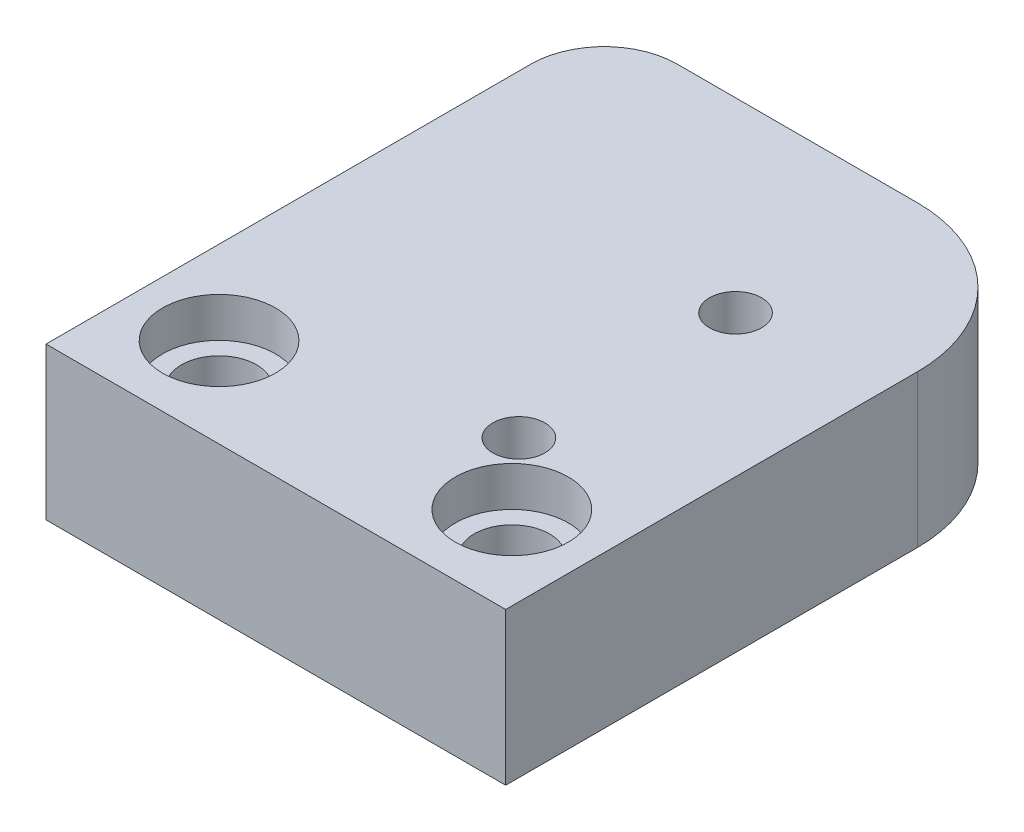
ISO-10303-21;
HEADER;
FILE_DESCRIPTION(('STEP AP214'),'2;1');
FILE_NAME('part.step','',(''),(''),'','','');
FILE_SCHEMA(('AUTOMOTIVE_DESIGN { 1 0 10303 214 1 1 1 1 }'));
ENDSEC;
DATA;
#1=APPLICATION_CONTEXT('core data for automotive mechanical design processes');
#2=APPLICATION_PROTOCOL_DEFINITION('international standard','automotive_design',2000,#1);
#3=PRODUCT_CONTEXT('',#1,'mechanical');
#4=PRODUCT('Part','Part','',(#3));
#5=PRODUCT_RELATED_PRODUCT_CATEGORY('part','',(#4));
#6=PRODUCT_DEFINITION_FORMATION('','',#4);
#7=PRODUCT_DEFINITION_CONTEXT('part definition',#1,'design');
#8=PRODUCT_DEFINITION('design','',#6,#7);
#9=PRODUCT_DEFINITION_SHAPE('','',#8);
#10=(LENGTH_UNIT() NAMED_UNIT(*) SI_UNIT(.MILLI.,.METRE.));
#11=(NAMED_UNIT(*) PLANE_ANGLE_UNIT() SI_UNIT($,.RADIAN.));
#12=(NAMED_UNIT(*) SI_UNIT($,.STERADIAN.) SOLID_ANGLE_UNIT());
#13=UNCERTAINTY_MEASURE_WITH_UNIT(LENGTH_MEASURE(1.E-05),#10,'distance_accuracy_value','');
#14=(GEOMETRIC_REPRESENTATION_CONTEXT(3) GLOBAL_UNCERTAINTY_ASSIGNED_CONTEXT((#13)) GLOBAL_UNIT_ASSIGNED_CONTEXT((#10,
#11,#12)) REPRESENTATION_CONTEXT('',''));
#15=CARTESIAN_POINT('',(0.,0.,0.));
#16=DIRECTION('',(0.,0.,1.));
#17=DIRECTION('',(1.,0.,0.));
#18=AXIS2_PLACEMENT_3D('',#15,#16,#17);
#19=CARTESIAN_POINT('',(-9.9695,6.604,-24.2062));
#20=DIRECTION('',(1.,0.,0.));
#21=DIRECTION('',(0.,0.,-1.));
#22=AXIS2_PLACEMENT_3D('',#19,#20,#21);
#23=PLANE('',#22);
#24=DIRECTION('',(0.,0.,1.));
#25=VECTOR('',#24,1.);
#26=CARTESIAN_POINT('',(-9.9695,6.604,-24.2062));
#27=LINE('',#26,#25);
#28=CARTESIAN_POINT('',(-9.9695,6.604,-21.0312));
#29=VERTEX_POINT('',#28);
#30=CARTESIAN_POINT('',(-9.96950000000001,6.604,0.));
#31=VERTEX_POINT('',#30);
#32=EDGE_CURVE('E85',#29,#31,#27,.T.);
#33=ORIENTED_EDGE('',*,*,#32,.F.);
#34=DIRECTION('',(0.,-1.,0.));
#35=VECTOR('',#34,1.);
#36=CARTESIAN_POINT('',(-9.9695,6.604,-21.0312));
#37=LINE('',#36,#35);
#38=CARTESIAN_POINT('',(-9.9695,0.,-21.0312));
#39=VERTEX_POINT('',#38);
#40=EDGE_CURVE('E123',#29,#39,#37,.T.);
#41=ORIENTED_EDGE('',*,*,#40,.T.);
#42=DIRECTION('',(0.,0.,1.));
#43=VECTOR('',#42,1.);
#44=CARTESIAN_POINT('',(-9.9695,0.,-24.2062));
#45=LINE('',#44,#43);
#46=CARTESIAN_POINT('',(-9.96950000000001,0.,0.));
#47=VERTEX_POINT('',#46);
#48=EDGE_CURVE('E107',#39,#47,#45,.T.);
#49=ORIENTED_EDGE('',*,*,#48,.T.);
#50=DIRECTION('',(0.,-1.,0.));
#51=VECTOR('',#50,1.);
#52=CARTESIAN_POINT('',(-9.96950000000001,6.604,0.));
#53=LINE('',#52,#51);
#54=EDGE_CURVE('E101',#31,#47,#53,.T.);
#55=ORIENTED_EDGE('',*,*,#54,.F.);
#56=EDGE_LOOP('',(#33,#41,#49,#55));
#57=FACE_BOUND('',#56,.T.);
#58=ADVANCED_FACE('F33',(#57),#23,.F.);
#59=CARTESIAN_POINT('',(-9.96950000000001,6.604,0.));
#60=DIRECTION('',(0.,0.,-1.));
#61=DIRECTION('',(-1.,0.,0.));
#62=AXIS2_PLACEMENT_3D('',#59,#60,#61);
#63=PLANE('',#62);
#64=DIRECTION('',(1.,0.,0.));
#65=VECTOR('',#64,1.);
#66=CARTESIAN_POINT('',(-9.96950000000001,0.,0.));
#67=LINE('',#66,#65);
#68=CARTESIAN_POINT('',(9.96950000000001,0.,0.));
#69=VERTEX_POINT('',#68);
#70=EDGE_CURVE('E128',#47,#69,#67,.T.);
#71=ORIENTED_EDGE('',*,*,#70,.T.);
#72=DIRECTION('',(0.,-1.,0.));
#73=VECTOR('',#72,1.);
#74=CARTESIAN_POINT('',(9.96950000000001,6.604,0.));
#75=LINE('',#74,#73);
#76=CARTESIAN_POINT('',(9.96950000000001,6.604,0.));
#77=VERTEX_POINT('',#76);
#78=EDGE_CURVE('E103',#77,#69,#75,.T.);
#79=ORIENTED_EDGE('',*,*,#78,.F.);
#80=DIRECTION('',(1.,0.,0.));
#81=VECTOR('',#80,1.);
#82=CARTESIAN_POINT('',(-9.96950000000001,6.604,0.));
#83=LINE('',#82,#81);
#84=EDGE_CURVE('E89',#31,#77,#83,.T.);
#85=ORIENTED_EDGE('',*,*,#84,.F.);
#86=ORIENTED_EDGE('',*,*,#54,.T.);
#87=EDGE_LOOP('',(#71,#79,#85,#86));
#88=FACE_BOUND('',#87,.T.);
#89=ADVANCED_FACE('F100',(#88),#63,.F.);
#90=CARTESIAN_POINT('',(9.9695,6.604,-24.2062));
#91=DIRECTION('',(-1.,0.,0.));
#92=DIRECTION('',(0.,0.,1.));
#93=AXIS2_PLACEMENT_3D('',#90,#91,#92);
#94=PLANE('',#93);
#95=DIRECTION('',(0.,0.,-1.));
#96=VECTOR('',#95,1.);
#97=CARTESIAN_POINT('',(9.9695,0.,-24.2062));
#98=LINE('',#97,#96);
#99=CARTESIAN_POINT('',(9.9695,0.,-17.8562));
#100=VERTEX_POINT('',#99);
#101=EDGE_CURVE('E131',#69,#100,#98,.T.);
#102=ORIENTED_EDGE('',*,*,#101,.T.);
#103=DIRECTION('',(0.,-1.,0.));
#104=VECTOR('',#103,1.);
#105=CARTESIAN_POINT('',(9.9695,6.604,-17.8562));
#106=LINE('',#105,#104);
#107=CARTESIAN_POINT('',(9.9695,6.604,-17.8562));
#108=VERTEX_POINT('',#107);
#109=EDGE_CURVE('E119',#100,#108,#106,.F.);
#110=ORIENTED_EDGE('',*,*,#109,.T.);
#111=DIRECTION('',(0.,0.,-1.));
#112=VECTOR('',#111,1.);
#113=CARTESIAN_POINT('',(9.9695,6.604,-24.2062));
#114=LINE('',#113,#112);
#115=EDGE_CURVE('E105',#77,#108,#114,.T.);
#116=ORIENTED_EDGE('',*,*,#115,.F.);
#117=ORIENTED_EDGE('',*,*,#78,.T.);
#118=EDGE_LOOP('',(#102,#110,#116,#117));
#119=FACE_BOUND('',#118,.T.);
#120=ADVANCED_FACE('F154',(#119),#94,.F.);
#121=CARTESIAN_POINT('',(-9.9695,6.604,-24.2062));
#122=DIRECTION('',(0.,0.,1.));
#123=DIRECTION('',(1.,0.,0.));
#124=AXIS2_PLACEMENT_3D('',#121,#122,#123);
#125=PLANE('',#124);
#126=DIRECTION('',(-1.,0.,0.));
#127=VECTOR('',#126,1.);
#128=CARTESIAN_POINT('',(-9.9695,0.,-24.2062));
#129=LINE('',#128,#127);
#130=CARTESIAN_POINT('',(3.61950000000001,0.,-24.2062));
#131=VERTEX_POINT('',#130);
#132=CARTESIAN_POINT('',(-6.7945,0.,-24.2062));
#133=VERTEX_POINT('',#132);
#134=EDGE_CURVE('E96',#131,#133,#129,.T.);
#135=ORIENTED_EDGE('',*,*,#134,.T.);
#136=DIRECTION('',(0.,-1.,0.));
#137=VECTOR('',#136,1.);
#138=CARTESIAN_POINT('',(-6.7945,6.604,-24.2062));
#139=LINE('',#138,#137);
#140=CARTESIAN_POINT('',(-6.7945,6.604,-24.2062));
#141=VERTEX_POINT('',#140);
#142=EDGE_CURVE('E41',#133,#141,#139,.F.);
#143=ORIENTED_EDGE('',*,*,#142,.T.);
#144=DIRECTION('',(-1.,0.,0.));
#145=VECTOR('',#144,1.);
#146=CARTESIAN_POINT('',(-9.9695,6.604,-24.2062));
#147=LINE('',#146,#145);
#148=CARTESIAN_POINT('',(3.61950000000001,6.604,-24.2062));
#149=VERTEX_POINT('',#148);
#150=EDGE_CURVE('E114',#149,#141,#147,.T.);
#151=ORIENTED_EDGE('',*,*,#150,.F.);
#152=DIRECTION('',(0.,-1.,0.));
#153=VECTOR('',#152,1.);
#154=CARTESIAN_POINT('',(3.61950000000001,6.604,-24.2062));
#155=LINE('',#154,#153);
#156=EDGE_CURVE('E109',#149,#131,#155,.T.);
#157=ORIENTED_EDGE('',*,*,#156,.T.);
#158=EDGE_LOOP('',(#135,#143,#151,#157));
#159=FACE_BOUND('',#158,.T.);
#160=ADVANCED_FACE('F140',(#159),#125,.F.);
#161=CARTESIAN_POINT('',(0.,6.604,0.));
#162=DIRECTION('',(0.,1.,0.));
#163=DIRECTION('',(0.,0.,1.));
#164=AXIS2_PLACEMENT_3D('',#161,#162,#163);
#165=PLANE('',#164);
#166=CARTESIAN_POINT('',(-6.35,6.604,-3.8862));
#167=DIRECTION('',(0.,1.,0.));
#168=DIRECTION('',(0.,0.,1.));
#169=AXIS2_PLACEMENT_3D('',#166,#167,#168);
#170=CIRCLE('',#169,2.4511);
#171=CARTESIAN_POINT('',(-6.35,6.604,-1.4351));
#172=VERTEX_POINT('',#171);
#173=EDGE_CURVE('E206',#172,#172,#170,.T.);
#174=ORIENTED_EDGE('',*,*,#173,.F.);
#175=EDGE_LOOP('',(#174));
#176=FACE_BOUND('',#175,.T.);
#177=CARTESIAN_POINT('',(6.35,6.604,-3.8862));
#178=DIRECTION('',(0.,1.,0.));
#179=DIRECTION('',(0.,0.,1.));
#180=AXIS2_PLACEMENT_3D('',#177,#178,#179);
#181=CIRCLE('',#180,2.4511);
#182=CARTESIAN_POINT('',(6.35,6.604,-1.4351));
#183=VERTEX_POINT('',#182);
#184=EDGE_CURVE('E216',#183,#183,#181,.T.);
#185=ORIENTED_EDGE('',*,*,#184,.F.);
#186=EDGE_LOOP('',(#185));
#187=FACE_BOUND('',#186,.T.);
#188=CARTESIAN_POINT('',(3.81,6.604,-16.129));
#189=DIRECTION('',(0.,1.,0.));
#190=DIRECTION('',(0.,0.,1.));
#191=AXIS2_PLACEMENT_3D('',#188,#189,#190);
#192=CIRCLE('',#191,1.13029999999999);
#193=CARTESIAN_POINT('',(3.81,6.604,-14.9987));
#194=VERTEX_POINT('',#193);
#195=EDGE_CURVE('E228',#194,#194,#192,.T.);
#196=ORIENTED_EDGE('',*,*,#195,.F.);
#197=EDGE_LOOP('',(#196));
#198=FACE_BOUND('',#197,.T.);
#199=CARTESIAN_POINT('',(3.81,6.604,-6.731));
#200=DIRECTION('',(0.,1.,0.));
#201=DIRECTION('',(0.,0.,1.));
#202=AXIS2_PLACEMENT_3D('',#199,#200,#201);
#203=CIRCLE('',#202,1.13029999999999);
#204=CARTESIAN_POINT('',(3.81,6.604,-5.60070000000001));
#205=VERTEX_POINT('',#204);
#206=EDGE_CURVE('E134',#205,#205,#203,.T.);
#207=ORIENTED_EDGE('',*,*,#206,.F.);
#208=EDGE_LOOP('',(#207));
#209=FACE_BOUND('',#208,.T.);
#210=ORIENTED_EDGE('',*,*,#150,.T.);
#211=CARTESIAN_POINT('',(-6.7945,6.604,-21.0312));
#212=DIRECTION('',(0.,1.,0.));
#213=DIRECTION('',(0.,0.,1.));
#214=AXIS2_PLACEMENT_3D('',#211,#212,#213);
#215=CIRCLE('',#214,3.175);
#216=EDGE_CURVE('E11',#141,#29,#215,.T.);
#217=ORIENTED_EDGE('',*,*,#216,.T.);
#218=ORIENTED_EDGE('',*,*,#32,.T.);
#219=ORIENTED_EDGE('',*,*,#84,.T.);
#220=ORIENTED_EDGE('',*,*,#115,.T.);
#221=CARTESIAN_POINT('',(3.6195,6.604,-17.8562));
#222=DIRECTION('',(0.,1.,0.));
#223=DIRECTION('',(0.,0.,1.));
#224=AXIS2_PLACEMENT_3D('',#221,#222,#223);
#225=CIRCLE('',#224,6.35);
#226=EDGE_CURVE('E121',#108,#149,#225,.T.);
#227=ORIENTED_EDGE('',*,*,#226,.T.);
#228=EDGE_LOOP('',(#210,#217,#218,#219,#220,#227));
#229=FACE_BOUND('',#228,.T.);
#230=ADVANCED_FACE('F87',(#176,#187,#198,#209,#229),#165,.T.);
#231=CARTESIAN_POINT('',(0.,0.,0.));
#232=DIRECTION('',(0.,1.,0.));
#233=DIRECTION('',(0.,0.,1.));
#234=AXIS2_PLACEMENT_3D('',#231,#232,#233);
#235=PLANE('',#234);
#236=CARTESIAN_POINT('',(-6.35,0.,-3.8862));
#237=DIRECTION('',(0.,1.,0.));
#238=DIRECTION('',(0.,0.,1.));
#239=AXIS2_PLACEMENT_3D('',#236,#237,#238);
#240=CIRCLE('',#239,1.63195);
#241=CARTESIAN_POINT('',(-6.35,0.,-2.25425));
#242=VERTEX_POINT('',#241);
#243=EDGE_CURVE('E213',#242,#242,#240,.T.);
#244=ORIENTED_EDGE('',*,*,#243,.T.);
#245=EDGE_LOOP('',(#244));
#246=FACE_BOUND('',#245,.T.);
#247=CARTESIAN_POINT('',(6.35,0.,-3.8862));
#248=DIRECTION('',(0.,1.,0.));
#249=DIRECTION('',(0.,0.,1.));
#250=AXIS2_PLACEMENT_3D('',#247,#248,#249);
#251=CIRCLE('',#250,1.63195);
#252=CARTESIAN_POINT('',(6.35,0.,-2.25425));
#253=VERTEX_POINT('',#252);
#254=EDGE_CURVE('E225',#253,#253,#251,.T.);
#255=ORIENTED_EDGE('',*,*,#254,.T.);
#256=EDGE_LOOP('',(#255));
#257=FACE_BOUND('',#256,.T.);
#258=CARTESIAN_POINT('',(3.81,0.,-16.129));
#259=DIRECTION('',(0.,1.,0.));
#260=DIRECTION('',(0.,0.,1.));
#261=AXIS2_PLACEMENT_3D('',#258,#259,#260);
#262=CIRCLE('',#261,1.13029999999999);
#263=CARTESIAN_POINT('',(3.81,0.,-14.9987));
#264=VERTEX_POINT('',#263);
#265=EDGE_CURVE('E231',#264,#264,#262,.T.);
#266=ORIENTED_EDGE('',*,*,#265,.T.);
#267=EDGE_LOOP('',(#266));
#268=FACE_BOUND('',#267,.T.);
#269=CARTESIAN_POINT('',(3.81,0.,-6.731));
#270=DIRECTION('',(0.,1.,0.));
#271=DIRECTION('',(0.,0.,1.));
#272=AXIS2_PLACEMENT_3D('',#269,#270,#271);
#273=CIRCLE('',#272,1.13029999999999);
#274=CARTESIAN_POINT('',(3.81,0.,-5.60070000000001));
#275=VERTEX_POINT('',#274);
#276=EDGE_CURVE('E129',#275,#275,#273,.T.);
#277=ORIENTED_EDGE('',*,*,#276,.T.);
#278=EDGE_LOOP('',(#277));
#279=FACE_BOUND('',#278,.T.);
#280=ORIENTED_EDGE('',*,*,#48,.F.);
#281=CARTESIAN_POINT('',(-6.7945,0.,-21.0312));
#282=DIRECTION('',(0.,1.,0.));
#283=DIRECTION('',(0.,0.,1.));
#284=AXIS2_PLACEMENT_3D('',#281,#282,#283);
#285=CIRCLE('',#284,3.175);
#286=EDGE_CURVE('E55',#39,#133,#285,.F.);
#287=ORIENTED_EDGE('',*,*,#286,.T.);
#288=ORIENTED_EDGE('',*,*,#134,.F.);
#289=CARTESIAN_POINT('',(3.6195,0.,-17.8562));
#290=DIRECTION('',(0.,1.,0.));
#291=DIRECTION('',(0.,0.,1.));
#292=AXIS2_PLACEMENT_3D('',#289,#290,#291);
#293=CIRCLE('',#292,6.35);
#294=EDGE_CURVE('E112',#131,#100,#293,.F.);
#295=ORIENTED_EDGE('',*,*,#294,.T.);
#296=ORIENTED_EDGE('',*,*,#101,.F.);
#297=ORIENTED_EDGE('',*,*,#70,.F.);
#298=EDGE_LOOP('',(#280,#287,#288,#295,#296,#297));
#299=FACE_BOUND('',#298,.T.);
#300=ADVANCED_FACE('F126',(#246,#257,#268,#279,#299),#235,.F.);
#301=CARTESIAN_POINT('',(3.81,6.604,-6.731));
#302=DIRECTION('',(0.,1.,0.));
#303=DIRECTION('',(0.,0.,1.));
#304=AXIS2_PLACEMENT_3D('',#301,#302,#303);
#305=CYLINDRICAL_SURFACE('',#304,1.13029999999999);
#306=ORIENTED_EDGE('',*,*,#276,.F.);
#307=EDGE_LOOP('',(#306));
#308=FACE_BOUND('',#307,.T.);
#309=ORIENTED_EDGE('',*,*,#206,.T.);
#310=EDGE_LOOP('',(#309));
#311=FACE_BOUND('',#310,.T.);
#312=ADVANCED_FACE('F164',(#308,#311),#305,.F.);
#313=CARTESIAN_POINT('',(3.81,6.604,-16.129));
#314=DIRECTION('',(0.,1.,0.));
#315=DIRECTION('',(0.,0.,1.));
#316=AXIS2_PLACEMENT_3D('',#313,#314,#315);
#317=CYLINDRICAL_SURFACE('',#316,1.13029999999999);
#318=ORIENTED_EDGE('',*,*,#265,.F.);
#319=EDGE_LOOP('',(#318));
#320=FACE_BOUND('',#319,.T.);
#321=ORIENTED_EDGE('',*,*,#195,.T.);
#322=EDGE_LOOP('',(#321));
#323=FACE_BOUND('',#322,.T.);
#324=ADVANCED_FACE('F171',(#320,#323),#317,.F.);
#325=CARTESIAN_POINT('',(6.35,6.604,-3.8862));
#326=DIRECTION('',(0.,1.,0.));
#327=DIRECTION('',(0.,0.,1.));
#328=AXIS2_PLACEMENT_3D('',#325,#326,#327);
#329=CYLINDRICAL_SURFACE('',#328,1.63195);
#330=ORIENTED_EDGE('',*,*,#254,.F.);
#331=EDGE_LOOP('',(#330));
#332=FACE_BOUND('',#331,.T.);
#333=CARTESIAN_POINT('',(6.35,4.8768,-3.8862));
#334=DIRECTION('',(0.,1.,0.));
#335=DIRECTION('',(0.,0.,1.));
#336=AXIS2_PLACEMENT_3D('',#333,#334,#335);
#337=CIRCLE('',#336,1.63195);
#338=CARTESIAN_POINT('',(6.35,4.8768,-2.25425));
#339=VERTEX_POINT('',#338);
#340=EDGE_CURVE('E222',#339,#339,#337,.T.);
#341=ORIENTED_EDGE('',*,*,#340,.T.);
#342=EDGE_LOOP('',(#341));
#343=FACE_BOUND('',#342,.T.);
#344=ADVANCED_FACE('F175',(#332,#343),#329,.F.);
#345=CARTESIAN_POINT('',(7.98195,4.8768,-3.8862));
#346=DIRECTION('',(0.,-1.,0.));
#347=DIRECTION('',(0.,0.,-1.));
#348=AXIS2_PLACEMENT_3D('',#345,#346,#347);
#349=PLANE('',#348);
#350=ORIENTED_EDGE('',*,*,#340,.F.);
#351=EDGE_LOOP('',(#350));
#352=FACE_BOUND('',#351,.T.);
#353=CARTESIAN_POINT('',(6.35,4.8768,-3.8862));
#354=DIRECTION('',(0.,1.,0.));
#355=DIRECTION('',(0.,0.,1.));
#356=AXIS2_PLACEMENT_3D('',#353,#354,#355);
#357=CIRCLE('',#356,2.4511);
#358=CARTESIAN_POINT('',(6.35,4.8768,-1.4351));
#359=VERTEX_POINT('',#358);
#360=EDGE_CURVE('E219',#359,#359,#357,.T.);
#361=ORIENTED_EDGE('',*,*,#360,.T.);
#362=EDGE_LOOP('',(#361));
#363=FACE_BOUND('',#362,.T.);
#364=ADVANCED_FACE('F179',(#352,#363),#349,.F.);
#365=CARTESIAN_POINT('',(6.35,6.604,-3.8862));
#366=DIRECTION('',(0.,1.,0.));
#367=DIRECTION('',(0.,0.,1.));
#368=AXIS2_PLACEMENT_3D('',#365,#366,#367);
#369=CYLINDRICAL_SURFACE('',#368,2.4511);
#370=ORIENTED_EDGE('',*,*,#360,.F.);
#371=EDGE_LOOP('',(#370));
#372=FACE_BOUND('',#371,.T.);
#373=ORIENTED_EDGE('',*,*,#184,.T.);
#374=EDGE_LOOP('',(#373));
#375=FACE_BOUND('',#374,.T.);
#376=ADVANCED_FACE('F183',(#372,#375),#369,.F.);
#377=CARTESIAN_POINT('',(-6.35,6.604,-3.8862));
#378=DIRECTION('',(0.,1.,0.));
#379=DIRECTION('',(0.,0.,1.));
#380=AXIS2_PLACEMENT_3D('',#377,#378,#379);
#381=CYLINDRICAL_SURFACE('',#380,1.63195);
#382=ORIENTED_EDGE('',*,*,#243,.F.);
#383=EDGE_LOOP('',(#382));
#384=FACE_BOUND('',#383,.T.);
#385=CARTESIAN_POINT('',(-6.35,4.8768,-3.8862));
#386=DIRECTION('',(0.,1.,0.));
#387=DIRECTION('',(0.,0.,1.));
#388=AXIS2_PLACEMENT_3D('',#385,#386,#387);
#389=CIRCLE('',#388,1.63195);
#390=CARTESIAN_POINT('',(-6.35,4.8768,-2.25425));
#391=VERTEX_POINT('',#390);
#392=EDGE_CURVE('E208',#391,#391,#389,.T.);
#393=ORIENTED_EDGE('',*,*,#392,.T.);
#394=EDGE_LOOP('',(#393));
#395=FACE_BOUND('',#394,.T.);
#396=ADVANCED_FACE('F187',(#384,#395),#381,.F.);
#397=CARTESIAN_POINT('',(-4.71805,4.8768,-3.8862));
#398=DIRECTION('',(0.,-1.,0.));
#399=DIRECTION('',(0.,0.,-1.));
#400=AXIS2_PLACEMENT_3D('',#397,#398,#399);
#401=PLANE('',#400);
#402=ORIENTED_EDGE('',*,*,#392,.F.);
#403=EDGE_LOOP('',(#402));
#404=FACE_BOUND('',#403,.T.);
#405=CARTESIAN_POINT('',(-6.35,4.8768,-3.8862));
#406=DIRECTION('',(0.,1.,0.));
#407=DIRECTION('',(0.,0.,1.));
#408=AXIS2_PLACEMENT_3D('',#405,#406,#407);
#409=CIRCLE('',#408,2.4511);
#410=CARTESIAN_POINT('',(-6.35,4.8768,-1.4351));
#411=VERTEX_POINT('',#410);
#412=EDGE_CURVE('E203',#411,#411,#409,.T.);
#413=ORIENTED_EDGE('',*,*,#412,.T.);
#414=EDGE_LOOP('',(#413));
#415=FACE_BOUND('',#414,.T.);
#416=ADVANCED_FACE('F191',(#404,#415),#401,.F.);
#417=CARTESIAN_POINT('',(-6.35,6.604,-3.8862));
#418=DIRECTION('',(0.,1.,0.));
#419=DIRECTION('',(0.,0.,1.));
#420=AXIS2_PLACEMENT_3D('',#417,#418,#419);
#421=CYLINDRICAL_SURFACE('',#420,2.4511);
#422=ORIENTED_EDGE('',*,*,#412,.F.);
#423=EDGE_LOOP('',(#422));
#424=FACE_BOUND('',#423,.T.);
#425=ORIENTED_EDGE('',*,*,#173,.T.);
#426=EDGE_LOOP('',(#425));
#427=FACE_BOUND('',#426,.T.);
#428=ADVANCED_FACE('F147',(#424,#427),#421,.F.);
#429=CARTESIAN_POINT('',(3.6195,6.604,-17.8562));
#430=DIRECTION('',(0.,-1.,0.));
#431=DIRECTION('',(0.,0.,-1.));
#432=AXIS2_PLACEMENT_3D('',#429,#430,#431);
#433=CYLINDRICAL_SURFACE('',#432,6.35);
#434=ORIENTED_EDGE('',*,*,#226,.F.);
#435=ORIENTED_EDGE('',*,*,#109,.F.);
#436=ORIENTED_EDGE('',*,*,#294,.F.);
#437=ORIENTED_EDGE('',*,*,#156,.F.);
#438=EDGE_LOOP('',(#434,#435,#436,#437));
#439=FACE_BOUND('',#438,.T.);
#440=ADVANCED_FACE('F143',(#439),#433,.T.);
#441=CARTESIAN_POINT('',(-6.7945,6.604,-21.0312));
#442=DIRECTION('',(0.,-1.,0.));
#443=DIRECTION('',(0.,0.,-1.));
#444=AXIS2_PLACEMENT_3D('',#441,#442,#443);
#445=CYLINDRICAL_SURFACE('',#444,3.175);
#446=ORIENTED_EDGE('',*,*,#216,.F.);
#447=ORIENTED_EDGE('',*,*,#142,.F.);
#448=ORIENTED_EDGE('',*,*,#286,.F.);
#449=ORIENTED_EDGE('',*,*,#40,.F.);
#450=EDGE_LOOP('',(#446,#447,#448,#449));
#451=FACE_BOUND('',#450,.T.);
#452=ADVANCED_FACE('F35',(#451),#445,.T.);
#453=CLOSED_SHELL('',(#58,#89,#120,#160,#230,#300,#312,#324,#344,#364,#376,#396,#416,#428,#440,#452));
#454=MANIFOLD_SOLID_BREP('B2',#453);
#455=ADVANCED_BREP_SHAPE_REPRESENTATION('',(#18,#454),#14);
#456=SHAPE_DEFINITION_REPRESENTATION(#9,#455);
ENDSEC;
END-ISO-10303-21;
